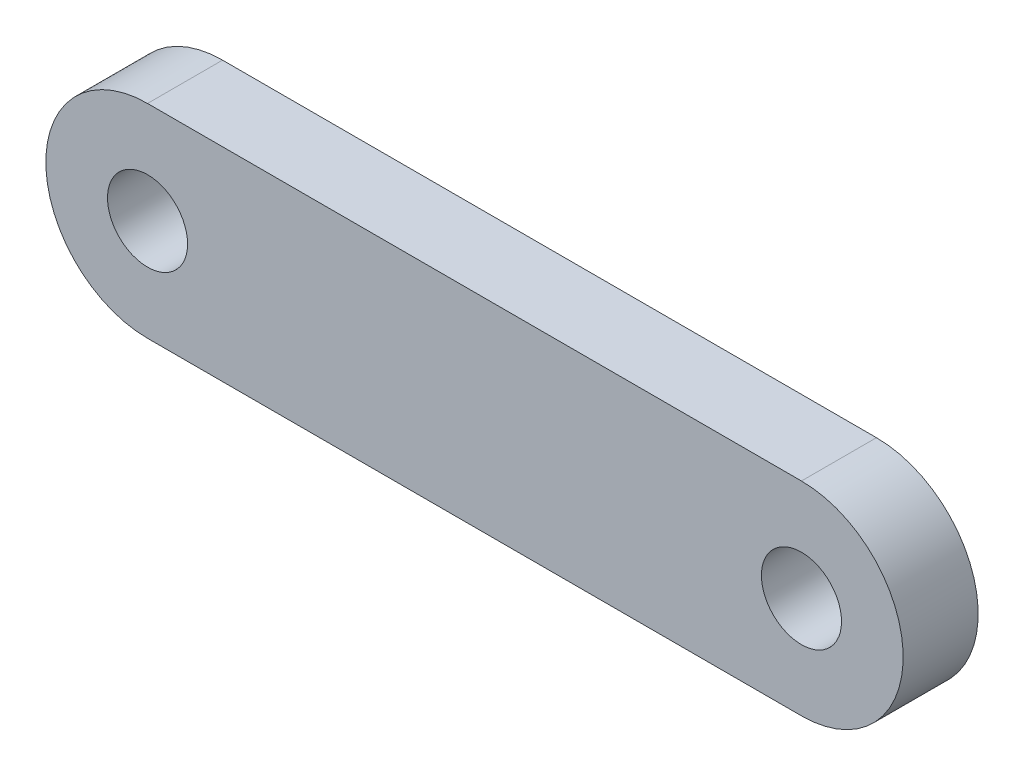
ISO-10303-21;
HEADER;
FILE_DESCRIPTION(('STEP AP214'),'2;1');
FILE_NAME('part.step','',(''),(''),'','','');
FILE_SCHEMA(('AUTOMOTIVE_DESIGN { 1 0 10303 214 1 1 1 1 }'));
ENDSEC;
DATA;
#1=APPLICATION_CONTEXT('core data for automotive mechanical design processes');
#2=APPLICATION_PROTOCOL_DEFINITION('international standard','automotive_design',2000,#1);
#3=PRODUCT_CONTEXT('',#1,'mechanical');
#4=PRODUCT('Part','Part','',(#3));
#5=PRODUCT_RELATED_PRODUCT_CATEGORY('part','',(#4));
#6=PRODUCT_DEFINITION_FORMATION('','',#4);
#7=PRODUCT_DEFINITION_CONTEXT('part definition',#1,'design');
#8=PRODUCT_DEFINITION('design','',#6,#7);
#9=PRODUCT_DEFINITION_SHAPE('','',#8);
#10=(LENGTH_UNIT() NAMED_UNIT(*) SI_UNIT(.MILLI.,.METRE.));
#11=(NAMED_UNIT(*) PLANE_ANGLE_UNIT() SI_UNIT($,.RADIAN.));
#12=(NAMED_UNIT(*) SI_UNIT($,.STERADIAN.) SOLID_ANGLE_UNIT());
#13=UNCERTAINTY_MEASURE_WITH_UNIT(LENGTH_MEASURE(1.E-05),#10,'distance_accuracy_value','');
#14=(GEOMETRIC_REPRESENTATION_CONTEXT(3) GLOBAL_UNCERTAINTY_ASSIGNED_CONTEXT((#13)) GLOBAL_UNIT_ASSIGNED_CONTEXT((#10,
#11,#12)) REPRESENTATION_CONTEXT('',''));
#15=CARTESIAN_POINT('',(0.,0.,0.));
#16=DIRECTION('',(0.,0.,1.));
#17=DIRECTION('',(1.,0.,0.));
#18=AXIS2_PLACEMENT_3D('',#15,#16,#17);
#19=CARTESIAN_POINT('',(25.7175,0.,5.9));
#20=DIRECTION('',(0.,0.,1.));
#21=DIRECTION('',(1.,0.,0.));
#22=AXIS2_PLACEMENT_3D('',#19,#20,#21);
#23=PLANE('',#22);
#24=CARTESIAN_POINT('',(25.7175,0.,5.9));
#25=DIRECTION('',(0.,0.,1.));
#26=DIRECTION('',(1.,0.,0.));
#27=AXIS2_PLACEMENT_3D('',#24,#25,#26);
#28=CIRCLE('',#27,3.15);
#29=CARTESIAN_POINT('',(28.8675,0.,5.9));
#30=VERTEX_POINT('',#29);
#31=EDGE_CURVE('E126',#30,#30,#28,.T.);
#32=ORIENTED_EDGE('',*,*,#31,.F.);
#33=EDGE_LOOP('',(#32));
#34=FACE_BOUND('',#33,.T.);
#35=CARTESIAN_POINT('',(25.7175,0.,5.9));
#36=DIRECTION('',(0.,0.,1.));
#37=DIRECTION('',(1.,0.,0.));
#38=AXIS2_PLACEMENT_3D('',#35,#36,#37);
#39=CIRCLE('',#38,8.);
#40=CARTESIAN_POINT('',(25.7175,-7.99999999999999,5.9));
#41=VERTEX_POINT('',#40);
#42=CARTESIAN_POINT('',(25.7175,8.00000000000001,5.9));
#43=VERTEX_POINT('',#42);
#44=EDGE_CURVE('E105',#41,#43,#39,.T.);
#45=ORIENTED_EDGE('',*,*,#44,.T.);
#46=DIRECTION('',(-1.,0.,0.));
#47=VECTOR('',#46,1.);
#48=CARTESIAN_POINT('',(25.7175,8.00000000000001,5.9));
#49=LINE('',#48,#47);
#50=CARTESIAN_POINT('',(-25.7175,8.,5.9));
#51=VERTEX_POINT('',#50);
#52=EDGE_CURVE('E100',#43,#51,#49,.T.);
#53=ORIENTED_EDGE('',*,*,#52,.T.);
#54=CARTESIAN_POINT('',(-25.7175,0.,5.9));
#55=DIRECTION('',(0.,0.,1.));
#56=DIRECTION('',(1.,0.,0.));
#57=AXIS2_PLACEMENT_3D('',#54,#55,#56);
#58=CIRCLE('',#57,8.);
#59=CARTESIAN_POINT('',(-25.7175,-8.00000000000001,5.9));
#60=VERTEX_POINT('',#59);
#61=EDGE_CURVE('E103',#51,#60,#58,.T.);
#62=ORIENTED_EDGE('',*,*,#61,.T.);
#63=DIRECTION('',(1.,0.,0.));
#64=VECTOR('',#63,1.);
#65=CARTESIAN_POINT('',(25.7175,-7.99999999999999,5.9));
#66=LINE('',#65,#64);
#67=EDGE_CURVE('E64',#60,#41,#66,.T.);
#68=ORIENTED_EDGE('',*,*,#67,.T.);
#69=EDGE_LOOP('',(#45,#53,#62,#68));
#70=FACE_BOUND('',#69,.T.);
#71=CARTESIAN_POINT('',(-25.7175,0.,5.9));
#72=DIRECTION('',(0.,0.,1.));
#73=DIRECTION('',(1.,0.,0.));
#74=AXIS2_PLACEMENT_3D('',#71,#72,#73);
#75=CIRCLE('',#74,3.15);
#76=CARTESIAN_POINT('',(-22.5675,0.,5.9));
#77=VERTEX_POINT('',#76);
#78=EDGE_CURVE('E149',#77,#77,#75,.T.);
#79=ORIENTED_EDGE('',*,*,#78,.F.);
#80=EDGE_LOOP('',(#79));
#81=FACE_BOUND('',#80,.T.);
#82=ADVANCED_FACE('F44',(#34,#70,#81),#23,.T.);
#83=CARTESIAN_POINT('',(25.7175,0.,0.));
#84=DIRECTION('',(0.,0.,1.));
#85=DIRECTION('',(1.,0.,0.));
#86=AXIS2_PLACEMENT_3D('',#83,#84,#85);
#87=PLANE('',#86);
#88=CARTESIAN_POINT('',(25.7175,0.,0.));
#89=DIRECTION('',(0.,0.,1.));
#90=DIRECTION('',(1.,0.,0.));
#91=AXIS2_PLACEMENT_3D('',#88,#89,#90);
#92=CIRCLE('',#91,8.);
#93=CARTESIAN_POINT('',(25.7175,-7.99999999999999,0.));
#94=VERTEX_POINT('',#93);
#95=CARTESIAN_POINT('',(25.7175,8.00000000000001,0.));
#96=VERTEX_POINT('',#95);
#97=EDGE_CURVE('E122',#94,#96,#92,.T.);
#98=ORIENTED_EDGE('',*,*,#97,.F.);
#99=DIRECTION('',(1.,0.,0.));
#100=VECTOR('',#99,1.);
#101=CARTESIAN_POINT('',(25.7175,-7.99999999999999,0.));
#102=LINE('',#101,#100);
#103=CARTESIAN_POINT('',(-25.7175,-8.00000000000001,0.));
#104=VERTEX_POINT('',#103);
#105=EDGE_CURVE('E91',#104,#94,#102,.T.);
#106=ORIENTED_EDGE('',*,*,#105,.F.);
#107=CARTESIAN_POINT('',(-25.7175,0.,0.));
#108=DIRECTION('',(0.,0.,1.));
#109=DIRECTION('',(1.,0.,0.));
#110=AXIS2_PLACEMENT_3D('',#107,#108,#109);
#111=CIRCLE('',#110,8.);
#112=CARTESIAN_POINT('',(-25.7175,8.,0.));
#113=VERTEX_POINT('',#112);
#114=EDGE_CURVE('E84',#113,#104,#111,.T.);
#115=ORIENTED_EDGE('',*,*,#114,.F.);
#116=DIRECTION('',(-1.,0.,0.));
#117=VECTOR('',#116,1.);
#118=CARTESIAN_POINT('',(25.7175,8.00000000000001,0.));
#119=LINE('',#118,#117);
#120=EDGE_CURVE('E110',#96,#113,#119,.T.);
#121=ORIENTED_EDGE('',*,*,#120,.F.);
#122=EDGE_LOOP('',(#98,#106,#115,#121));
#123=FACE_BOUND('',#122,.T.);
#124=CARTESIAN_POINT('',(25.7175,0.,0.));
#125=DIRECTION('',(0.,0.,1.));
#126=DIRECTION('',(1.,0.,0.));
#127=AXIS2_PLACEMENT_3D('',#124,#125,#126);
#128=CIRCLE('',#127,3.15);
#129=CARTESIAN_POINT('',(28.8675,0.,0.));
#130=VERTEX_POINT('',#129);
#131=EDGE_CURVE('E145',#130,#130,#128,.T.);
#132=ORIENTED_EDGE('',*,*,#131,.T.);
#133=EDGE_LOOP('',(#132));
#134=FACE_BOUND('',#133,.T.);
#135=CARTESIAN_POINT('',(-25.7175,0.,0.));
#136=DIRECTION('',(0.,0.,1.));
#137=DIRECTION('',(1.,0.,0.));
#138=AXIS2_PLACEMENT_3D('',#135,#136,#137);
#139=CIRCLE('',#138,3.15);
#140=CARTESIAN_POINT('',(-22.5675,0.,0.));
#141=VERTEX_POINT('',#140);
#142=EDGE_CURVE('E153',#141,#141,#139,.T.);
#143=ORIENTED_EDGE('',*,*,#142,.T.);
#144=EDGE_LOOP('',(#143));
#145=FACE_BOUND('',#144,.T.);
#146=ADVANCED_FACE('F139',(#123,#134,#145),#87,.F.);
#147=CARTESIAN_POINT('',(25.7175,0.,5.9));
#148=DIRECTION('',(0.,0.,-1.));
#149=DIRECTION('',(-1.,0.,0.));
#150=AXIS2_PLACEMENT_3D('',#147,#148,#149);
#151=CYLINDRICAL_SURFACE('',#150,8.);
#152=ORIENTED_EDGE('',*,*,#97,.T.);
#153=DIRECTION('',(0.,0.,-1.));
#154=VECTOR('',#153,1.);
#155=CARTESIAN_POINT('',(25.7175,8.00000000000001,5.9));
#156=LINE('',#155,#154);
#157=EDGE_CURVE('E11',#43,#96,#156,.T.);
#158=ORIENTED_EDGE('',*,*,#157,.F.);
#159=ORIENTED_EDGE('',*,*,#44,.F.);
#160=DIRECTION('',(0.,0.,-1.));
#161=VECTOR('',#160,1.);
#162=CARTESIAN_POINT('',(25.7175,-7.99999999999999,5.9));
#163=LINE('',#162,#161);
#164=EDGE_CURVE('E118',#41,#94,#163,.T.);
#165=ORIENTED_EDGE('',*,*,#164,.T.);
#166=EDGE_LOOP('',(#152,#158,#159,#165));
#167=FACE_BOUND('',#166,.T.);
#168=ADVANCED_FACE('F46',(#167),#151,.T.);
#169=CARTESIAN_POINT('',(25.7175,8.00000000000001,5.9));
#170=DIRECTION('',(0.,-1.,0.));
#171=DIRECTION('',(1.,0.,0.));
#172=AXIS2_PLACEMENT_3D('',#169,#170,#171);
#173=PLANE('',#172);
#174=ORIENTED_EDGE('',*,*,#120,.T.);
#175=DIRECTION('',(0.,0.,-1.));
#176=VECTOR('',#175,1.);
#177=CARTESIAN_POINT('',(-25.7175,8.,5.9));
#178=LINE('',#177,#176);
#179=EDGE_CURVE('E54',#51,#113,#178,.T.);
#180=ORIENTED_EDGE('',*,*,#179,.F.);
#181=ORIENTED_EDGE('',*,*,#52,.F.);
#182=ORIENTED_EDGE('',*,*,#157,.T.);
#183=EDGE_LOOP('',(#174,#180,#181,#182));
#184=FACE_BOUND('',#183,.T.);
#185=ADVANCED_FACE('F109',(#184),#173,.F.);
#186=CARTESIAN_POINT('',(-25.7175,0.,5.9));
#187=DIRECTION('',(0.,0.,-1.));
#188=DIRECTION('',(-1.,0.,0.));
#189=AXIS2_PLACEMENT_3D('',#186,#187,#188);
#190=CYLINDRICAL_SURFACE('',#189,8.);
#191=ORIENTED_EDGE('',*,*,#114,.T.);
#192=DIRECTION('',(0.,0.,-1.));
#193=VECTOR('',#192,1.);
#194=CARTESIAN_POINT('',(-25.7175,-8.00000000000001,5.9));
#195=LINE('',#194,#193);
#196=EDGE_CURVE('E112',#60,#104,#195,.T.);
#197=ORIENTED_EDGE('',*,*,#196,.F.);
#198=ORIENTED_EDGE('',*,*,#61,.F.);
#199=ORIENTED_EDGE('',*,*,#179,.T.);
#200=EDGE_LOOP('',(#191,#197,#198,#199));
#201=FACE_BOUND('',#200,.T.);
#202=ADVANCED_FACE('F113',(#201),#190,.T.);
#203=CARTESIAN_POINT('',(25.7175,-7.99999999999999,5.9));
#204=DIRECTION('',(0.,1.,0.));
#205=DIRECTION('',(-1.,0.,0.));
#206=AXIS2_PLACEMENT_3D('',#203,#204,#205);
#207=PLANE('',#206);
#208=ORIENTED_EDGE('',*,*,#105,.T.);
#209=ORIENTED_EDGE('',*,*,#164,.F.);
#210=ORIENTED_EDGE('',*,*,#67,.F.);
#211=ORIENTED_EDGE('',*,*,#196,.T.);
#212=EDGE_LOOP('',(#208,#209,#210,#211));
#213=FACE_BOUND('',#212,.T.);
#214=ADVANCED_FACE('F136',(#213),#207,.F.);
#215=CARTESIAN_POINT('',(25.7175,0.,5.9));
#216=DIRECTION('',(0.,0.,-1.));
#217=DIRECTION('',(-1.,0.,0.));
#218=AXIS2_PLACEMENT_3D('',#215,#216,#217);
#219=CYLINDRICAL_SURFACE('',#218,3.15);
#220=ORIENTED_EDGE('',*,*,#31,.T.);
#221=EDGE_LOOP('',(#220));
#222=FACE_BOUND('',#221,.T.);
#223=ORIENTED_EDGE('',*,*,#131,.F.);
#224=EDGE_LOOP('',(#223));
#225=FACE_BOUND('',#224,.T.);
#226=ADVANCED_FACE('F171',(#222,#225),#219,.F.);
#227=CARTESIAN_POINT('',(-25.7175,0.,5.9));
#228=DIRECTION('',(0.,0.,-1.));
#229=DIRECTION('',(-1.,0.,0.));
#230=AXIS2_PLACEMENT_3D('',#227,#228,#229);
#231=CYLINDRICAL_SURFACE('',#230,3.15);
#232=ORIENTED_EDGE('',*,*,#78,.T.);
#233=EDGE_LOOP('',(#232));
#234=FACE_BOUND('',#233,.T.);
#235=ORIENTED_EDGE('',*,*,#142,.F.);
#236=EDGE_LOOP('',(#235));
#237=FACE_BOUND('',#236,.T.);
#238=ADVANCED_FACE('F160',(#234,#237),#231,.F.);
#239=CLOSED_SHELL('',(#82,#146,#168,#185,#202,#214,#226,#238));
#240=MANIFOLD_SOLID_BREP('B2',#239);
#241=ADVANCED_BREP_SHAPE_REPRESENTATION('',(#18,#240),#14);
#242=SHAPE_DEFINITION_REPRESENTATION(#9,#241);
ENDSEC;
END-ISO-10303-21;
